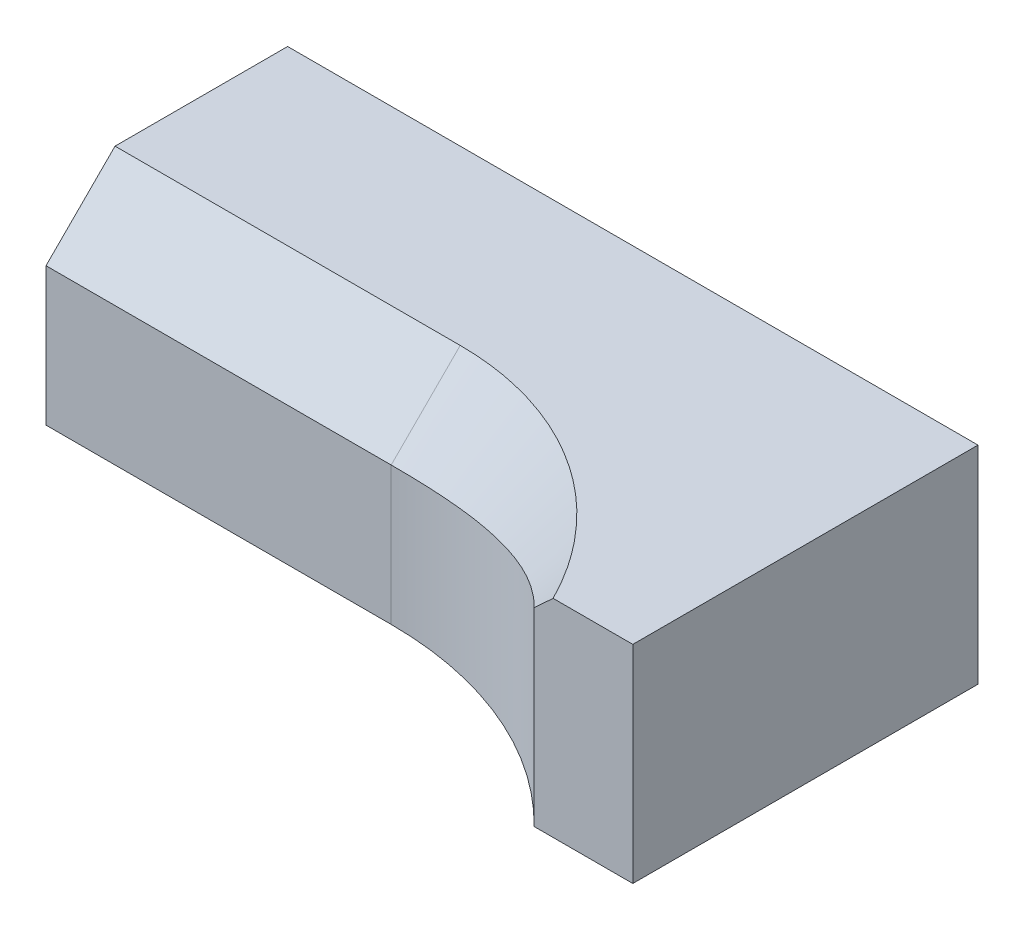
ISO-10303-21;
HEADER;
FILE_DESCRIPTION(('STEP AP214'),'2;1');
FILE_NAME('part.step','',(''),(''),'','','');
FILE_SCHEMA(('AUTOMOTIVE_DESIGN { 1 0 10303 214 1 1 1 1 }'));
ENDSEC;
DATA;
#1=APPLICATION_CONTEXT('core data for automotive mechanical design processes');
#2=APPLICATION_PROTOCOL_DEFINITION('international standard','automotive_design',2000,#1);
#3=PRODUCT_CONTEXT('',#1,'mechanical');
#4=PRODUCT('Part','Part','',(#3));
#5=PRODUCT_RELATED_PRODUCT_CATEGORY('part','',(#4));
#6=PRODUCT_DEFINITION_FORMATION('','',#4);
#7=PRODUCT_DEFINITION_CONTEXT('part definition',#1,'design');
#8=PRODUCT_DEFINITION('design','',#6,#7);
#9=PRODUCT_DEFINITION_SHAPE('','',#8);
#10=(LENGTH_UNIT() NAMED_UNIT(*) SI_UNIT(.MILLI.,.METRE.));
#11=(NAMED_UNIT(*) PLANE_ANGLE_UNIT() SI_UNIT($,.RADIAN.));
#12=(NAMED_UNIT(*) SI_UNIT($,.STERADIAN.) SOLID_ANGLE_UNIT());
#13=UNCERTAINTY_MEASURE_WITH_UNIT(LENGTH_MEASURE(1.E-05),#10,'distance_accuracy_value','');
#14=(GEOMETRIC_REPRESENTATION_CONTEXT(3) GLOBAL_UNCERTAINTY_ASSIGNED_CONTEXT((#13)) GLOBAL_UNIT_ASSIGNED_CONTEXT((#10,
#11,#12)) REPRESENTATION_CONTEXT('',''));
#15=CARTESIAN_POINT('',(0.,0.,0.));
#16=DIRECTION('',(0.,0.,1.));
#17=DIRECTION('',(1.,0.,0.));
#18=AXIS2_PLACEMENT_3D('',#15,#16,#17);
#19=CARTESIAN_POINT('',(-5.00000000000113,30.,-10.));
#20=CARTESIAN_POINT('',(13.3333333333364,30.,-10.));
#21=CARTESIAN_POINT('',(31.6666666666739,30.,-10.));
#22=CARTESIAN_POINT('',(50.0000000000114,30.,-10.));
#23=CARTESIAN_POINT('',(-5.00000000000113,20.,0.));
#24=CARTESIAN_POINT('',(13.3333333333364,20.,0.));
#25=CARTESIAN_POINT('',(31.6666666666739,20.,0.));
#26=CARTESIAN_POINT('',(50.0000000000114,20.,0.));
#27=B_SPLINE_SURFACE_WITH_KNOTS('',1,3,((#19,#20,#21,#22),(#23,#24,#25,#26)),.UNSPECIFIED.,.F.,
.F.,.F.,(2,2),(4,4),(0.,1.),(-0.00500000000000112,0.0500000000000114),.UNSPECIFIED.);
#28=CARTESIAN_POINT('',(50.0000000000114,30.,-10.));
#29=CARTESIAN_POINT('',(50.0000000000114,20.,0.));
#30=B_SPLINE_CURVE_WITH_KNOTS('',1,(#28,#29),.UNSPECIFIED.,.F.,.F.,(2,2),(0.,1.),.UNSPECIFIED.);
#31=CARTESIAN_POINT('',(50.0000000000114,30.,-10.));
#32=VERTEX_POINT('',#31);
#33=CARTESIAN_POINT('',(50.0000000000114,20.,0.));
#34=VERTEX_POINT('',#33);
#35=EDGE_CURVE('E11',#32,#34,#30,.T.);
#36=CARTESIAN_POINT('',(50.0000000000114,30.,-10.));
#37=CARTESIAN_POINT('',(31.6666666666739,30.,-10.));
#38=CARTESIAN_POINT('',(13.3333333333364,30.,-10.));
#39=CARTESIAN_POINT('',(-5.00000000000113,30.,-10.));
#40=B_SPLINE_CURVE_WITH_KNOTS('',3,(#36,#37,#38,#39),.UNSPECIFIED.,.F.,.F.,(4,4),
(-0.00500000000000112,0.0500000000000114),.UNSPECIFIED.);
#41=CARTESIAN_POINT('',(0.,30.,-10.));
#42=VERTEX_POINT('',#41);
#43=EDGE_CURVE('E131',#42,#32,#40,.F.);
#44=CARTESIAN_POINT('',(0.,30.,-10.));
#45=CARTESIAN_POINT('',(0.,20.,0.));
#46=B_SPLINE_CURVE_WITH_KNOTS('',1,(#44,#45),.UNSPECIFIED.,.F.,.F.,(2,2),(0.,1.),.UNSPECIFIED.);
#47=CARTESIAN_POINT('',(0.,20.,0.));
#48=VERTEX_POINT('',#47);
#49=EDGE_CURVE('E56',#48,#42,#46,.F.);
#50=CARTESIAN_POINT('',(-5.00000000000113,20.,0.));
#51=CARTESIAN_POINT('',(13.3333333333364,20.,0.));
#52=CARTESIAN_POINT('',(31.6666666666739,20.,0.));
#53=CARTESIAN_POINT('',(50.0000000000114,20.,0.));
#54=B_SPLINE_CURVE_WITH_KNOTS('',3,(#50,#51,#52,#53),.UNSPECIFIED.,.F.,.F.,(4,4),
(-0.00500000000000112,0.0500000000000114),.UNSPECIFIED.);
#55=EDGE_CURVE('E267',#34,#48,#54,.F.);
#56=ORIENTED_EDGE('',*,*,#35,.F.);
#57=ORIENTED_EDGE('',*,*,#43,.F.);
#58=ORIENTED_EDGE('',*,*,#49,.F.);
#59=ORIENTED_EDGE('',*,*,#55,.F.);
#60=EDGE_LOOP('',(#56,#57,#58,#59));
#61=FACE_BOUND('',#60,.T.);
#62=ADVANCED_FACE('F37',(#61),#27,.T.);
#63=CARTESIAN_POINT('',(50.0000000000114,30.,-10.));
#64=CARTESIAN_POINT('',(52.1054454325357,30.,-10.0000000000073));
#65=CARTESIAN_POINT('',(54.2211702506604,30.,-9.82468905903506));
#66=CARTESIAN_POINT('',(58.4581062829058,30.,-9.1248387362801));
#67=CARTESIAN_POINT('',(60.5477726799049,30.,-8.60537906626276));
#68=CARTESIAN_POINT('',(63.631619388189,30.,-7.57375582507435));
#69=CARTESIAN_POINT('',(64.6480874828233,30.,-7.18857099443179));
#70=CARTESIAN_POINT('',(66.6580620557991,30.,-6.33558049926557));
#71=CARTESIAN_POINT('',(67.6539001880962,30.,-5.86662090988998));
#72=CARTESIAN_POINT('',(69.6109290033174,30.,-4.85186416263024));
#73=CARTESIAN_POINT('',(70.5701237964009,30.,-4.30705476146158));
#74=CARTESIAN_POINT('',(72.4498741535874,30.,-3.14257390410074));
#75=CARTESIAN_POINT('',(73.3722547012452,30.,-2.52151304699523));
#76=CARTESIAN_POINT('',(76.0634093678156,30.,-0.559762614607957));
#77=CARTESIAN_POINT('',(77.7579710608643,30.,0.880845826832923));
#78=CARTESIAN_POINT('',(80.1505014734552,30.,3.24092071887319));
#79=CARTESIAN_POINT('',(80.9231262564942,30.,4.0608060544991));
#80=CARTESIAN_POINT('',(82.4186051135371,30.,5.76696413571837));
#81=CARTESIAN_POINT('',(83.139262843814,30.,6.65092846070325));
#82=CARTESIAN_POINT('',(85.2005879492319,30.,9.37508418649001));
#83=CARTESIAN_POINT('',(86.4481628663955,30.,11.295479520296));
#84=CARTESIAN_POINT('',(87.8493292381453,30.,13.8263380833428));
#85=CARTESIAN_POINT('',(88.1216473987594,30.,14.3390280157385));
#86=CARTESIAN_POINT('',(88.6504534925154,30.,15.3774443201008));
#87=CARTESIAN_POINT('',(88.912174558706,30.,15.8988611252728));
#88=CARTESIAN_POINT('',(89.7010663645784,30.,17.460040974439));
#89=CARTESIAN_POINT('',(90.2269942351436,30.,18.5008275405513));
#90=CARTESIAN_POINT('',(90.752922105737,30.,19.5416141066555));
#91=CARTESIAN_POINT('',(50.0000000000114,20.,0.));
#92=CARTESIAN_POINT('',(51.7544740831113,20.0000000000292,0.));
#93=CARTESIAN_POINT('',(53.5177817116621,20.0648969708573,0.0917201759601044));
#94=CARTESIAN_POINT('',(57.0815476281944,20.3117181240894,0.471595358266706));
#95=CARTESIAN_POINT('',(58.8554728759382,20.4920055011781,0.756872802646197));
#96=CARTESIAN_POINT('',(61.5200500924567,20.8442964012276,1.336721340673));
#97=CARTESIAN_POINT('',(62.4062550484878,20.9751920659311,1.55488303031477));
#98=CARTESIAN_POINT('',(64.178076566605,21.2631504589081,2.04349191813337));
#99=CARTESIAN_POINT('',(65.0657910969154,21.4205405253271,2.31466358609776));
#100=CARTESIAN_POINT('',(66.8331711344106,21.758012679072,2.90951561257188));
#101=CARTESIAN_POINT('',(67.7110418185186,21.9379610043211,3.23244510398838));
#102=CARTESIAN_POINT('',(69.4579258496428,22.3203311977452,3.93185140600266));
#103=CARTESIAN_POINT('',(70.328717701442,22.5231846439757,4.30920865964614));
#104=CARTESIAN_POINT('',(72.9139347305588,23.1595071526229,5.51885453438657));
#105=CARTESIAN_POINT('',(74.6031586316657,23.6224552747128,6.42818594066864));
#106=CARTESIAN_POINT('',(77.0972555888223,24.3738186138075,7.96794867813995));
#107=CARTESIAN_POINT('',(77.9219476855979,24.6336349246182,8.51066026756141));
#108=CARTESIAN_POINT('',(79.5589112974834,25.1701493426328,9.66054986866433));
#109=CARTESIAN_POINT('',(80.3688100847084,25.44603126314,10.2662797828309));
#110=CARTESIAN_POINT('',(82.7533882450935,26.2915628974574,12.1668379395328));
#111=CARTESIAN_POINT('',(84.2915231375691,26.8819463176469,13.5499212001902));
#112=CARTESIAN_POINT('',(86.1473891941793,27.6474046793407,15.4507806937591));
#113=CARTESIAN_POINT('',(86.5151777820275,27.8018233977288,15.8396017142634));
#114=CARTESIAN_POINT('',(87.2437214499585,28.1129723887259,16.6354045124004));
#115=CARTESIAN_POINT('',(87.6047405756152,28.2629303992049,17.0426857304355));
#116=CARTESIAN_POINT('',(88.676056609013,28.6800128445489,18.2924779324763));
#117=CARTESIAN_POINT('',(89.37434930724,28.9207431863644,19.1627708716983));
#118=CARTESIAN_POINT('',(90.0500908322028,29.1225597009517,20.0669041973067));
#119=B_SPLINE_SURFACE_WITH_KNOTS('',1,3,((#63,#64,#65,#66,#67,#68,#69,#70,#71,#72,#73,#74,#75,
#76,#77,#78,#79,#80,#81,#82,#83,#84,#85,#86,#87,#88,#89,#90),(#91,#92,#93,#94,#95,#96,#97,#98,
#99,#100,#101,#102,#103,#104,#105,#106,#107,#108,#109,#110,#111,#112,#113,#114,#115,#116,#117,
#118)),.UNSPECIFIED.,.F.,.F.,.F.,(2,2),(4,2,2,2,2,2,2,2,2,2,2,2,2,4),(0.,1.),(0.,0.1375,0.275,
0.34375,0.4125,0.48125,0.55,0.6875,0.75625,0.825,0.9625,0.996875,1.03125,1.1),.UNSPECIFIED.);
#120=CARTESIAN_POINT('',(90.752922105737,30.,19.5416141066555));
#121=CARTESIAN_POINT('',(90.2269942351436,30.,18.5008275405513));
#122=CARTESIAN_POINT('',(89.7010663645784,30.,17.460040974439));
#123=CARTESIAN_POINT('',(88.912174558706,30.,15.8988611252728));
#124=CARTESIAN_POINT('',(88.6504534925154,30.,15.3774443201008));
#125=CARTESIAN_POINT('',(88.1216473987594,30.,14.3390280157385));
#126=CARTESIAN_POINT('',(87.8493292381453,30.,13.8263380833428));
#127=CARTESIAN_POINT('',(86.4481628663955,30.,11.295479520296));
#128=CARTESIAN_POINT('',(85.2005879492319,30.,9.37508418649001));
#129=CARTESIAN_POINT('',(83.139262843814,30.,6.65092846070325));
#130=CARTESIAN_POINT('',(82.4186051135371,30.,5.76696413571837));
#131=CARTESIAN_POINT('',(80.9231262564942,30.,4.0608060544991));
#132=CARTESIAN_POINT('',(80.1505014734552,30.,3.24092071887319));
#133=CARTESIAN_POINT('',(77.7579710608643,30.,0.880845826832923));
#134=CARTESIAN_POINT('',(76.0634093678156,30.,-0.559762614607957));
#135=CARTESIAN_POINT('',(73.3722547012452,30.,-2.52151304699523));
#136=CARTESIAN_POINT('',(72.4498741535874,30.,-3.14257390410074));
#137=CARTESIAN_POINT('',(70.5701237964009,30.,-4.30705476146158));
#138=CARTESIAN_POINT('',(69.6109290033174,30.,-4.85186416263024));
#139=CARTESIAN_POINT('',(67.6539001880962,30.,-5.86662090988998));
#140=CARTESIAN_POINT('',(66.6580620557991,30.,-6.33558049926557));
#141=CARTESIAN_POINT('',(64.6480874828233,30.,-7.18857099443179));
#142=CARTESIAN_POINT('',(63.631619388189,30.,-7.57375582507435));
#143=CARTESIAN_POINT('',(60.5477726799049,30.,-8.60537906626276));
#144=CARTESIAN_POINT('',(58.4581062829058,30.,-9.1248387362801));
#145=CARTESIAN_POINT('',(54.2211702506604,30.,-9.82468905903506));
#146=CARTESIAN_POINT('',(52.1054454325357,30.,-10.0000000000073));
#147=CARTESIAN_POINT('',(50.0000000000114,30.,-10.));
#148=B_SPLINE_CURVE_WITH_KNOTS('',3,(#120,#121,#122,#123,#124,#125,#126,#127,#128,#129,#130,
#131,#132,#133,#134,#135,#136,#137,#138,#139,#140,#141,#142,#143,#144,#145,#146,#147),
.UNSPECIFIED.,.F.,.F.,(4,2,2,2,2,2,2,2,2,2,2,2,2,4),(0.,0.0687500000000001,0.103125,0.1375,
0.275,0.34375,0.4125,0.55,0.61875,0.6875,0.75625,0.825,0.9625,1.1),.UNSPECIFIED.);
#149=CARTESIAN_POINT('',(88.4579641250251,30.,15.));
#150=VERTEX_POINT('',#149);
#151=EDGE_CURVE('E134',#32,#150,#148,.F.);
#152=CARTESIAN_POINT('',(50.0000000000114,20.,0.));
#153=CARTESIAN_POINT('',(51.7544740831113,20.0000000000292,0.));
#154=CARTESIAN_POINT('',(53.5177817116621,20.0648969708573,0.0917201759601044));
#155=CARTESIAN_POINT('',(57.0815476281944,20.3117181240894,0.471595358266706));
#156=CARTESIAN_POINT('',(58.8554728759382,20.4920055011781,0.756872802646197));
#157=CARTESIAN_POINT('',(61.5200500924567,20.8442964012276,1.336721340673));
#158=CARTESIAN_POINT('',(62.4062550484878,20.9751920659311,1.55488303031477));
#159=CARTESIAN_POINT('',(64.178076566605,21.2631504589081,2.04349191813337));
#160=CARTESIAN_POINT('',(65.0657910969154,21.4205405253271,2.31466358609776));
#161=CARTESIAN_POINT('',(66.8331711344106,21.758012679072,2.90951561257188));
#162=CARTESIAN_POINT('',(67.7110418185186,21.9379610043211,3.23244510398838));
#163=CARTESIAN_POINT('',(69.4579258496428,22.3203311977452,3.93185140600266));
#164=CARTESIAN_POINT('',(70.328717701442,22.5231846439757,4.30920865964614));
#165=CARTESIAN_POINT('',(72.9139347305588,23.1595071526229,5.51885453438657));
#166=CARTESIAN_POINT('',(74.6031586316657,23.6224552747128,6.42818594066864));
#167=CARTESIAN_POINT('',(77.0972555888223,24.3738186138075,7.96794867813995));
#168=CARTESIAN_POINT('',(77.9219476855979,24.6336349246182,8.51066026756141));
#169=CARTESIAN_POINT('',(79.5589112974834,25.1701493426328,9.66054986866433));
#170=CARTESIAN_POINT('',(80.3688100847084,25.44603126314,10.2662797828309));
#171=CARTESIAN_POINT('',(82.7533882450935,26.2915628974574,12.1668379395328));
#172=CARTESIAN_POINT('',(84.2915231375691,26.8819463176469,13.5499212001902));
#173=CARTESIAN_POINT('',(86.1473891941793,27.6474046793407,15.4507806937591));
#174=CARTESIAN_POINT('',(86.5151777820275,27.8018233977288,15.8396017142634));
#175=CARTESIAN_POINT('',(87.2437214499585,28.1129723887259,16.6354045124004));
#176=CARTESIAN_POINT('',(87.6047405756152,28.2629303992049,17.0426857304355));
#177=CARTESIAN_POINT('',(88.676056609013,28.6800128445489,18.2924779324763));
#178=CARTESIAN_POINT('',(89.37434930724,28.9207431863644,19.1627708716983));
#179=CARTESIAN_POINT('',(90.0500908322028,29.1225597009517,20.0669041973067));
#180=B_SPLINE_CURVE_WITH_KNOTS('',3,(#152,#153,#154,#155,#156,#157,#158,#159,#160,#161,#162,
#163,#164,#165,#166,#167,#168,#169,#170,#171,#172,#173,#174,#175,#176,#177,#178,#179),
.UNSPECIFIED.,.F.,.F.,(4,2,2,2,2,2,2,2,2,2,2,2,2,4),(0.,0.1375,0.275,0.34375,0.4125,0.48125,
0.55,0.6875,0.75625,0.825,0.9625,0.996875,1.03125,1.1),.UNSPECIFIED.);
#181=CARTESIAN_POINT('',(85.7070471943579,27.4656458875371,15.0000930680158));
#182=VERTEX_POINT('',#181);
#183=EDGE_CURVE('E175',#182,#34,#180,.F.);
#184=CARTESIAN_POINT('',(85.707128750792,27.4658494954564,14.9999852040555));
#185=CARTESIAN_POINT('',(85.8251932731406,27.5739748387153,14.99998181484));
#186=CARTESIAN_POINT('',(85.9432121822952,27.6821499785142,14.9999751939056));
#187=CARTESIAN_POINT('',(86.177144244438,27.896741326948,14.9999645582343));
#188=CARTESIAN_POINT('',(86.2930588578456,28.0031559435147,14.9999605008206));
#189=CARTESIAN_POINT('',(86.5226815359921,28.2141149333432,14.9999633135064));
#190=CARTESIAN_POINT('',(86.6363910238837,28.3186577576363,14.9999699842633));
#191=CARTESIAN_POINT('',(86.8615182132862,28.5257817142158,14.9999911522664));
#192=CARTESIAN_POINT('',(86.9729373286707,28.6283613096469,15.0000054942166));
#193=CARTESIAN_POINT('',(87.2019752531721,28.8393931084867,14.9999941960182));
#194=CARTESIAN_POINT('',(87.3195894311525,28.9478503380365,14.9999662560807));
#195=CARTESIAN_POINT('',(87.5528084755893,29.163062300216,14.9998987783109));
#196=CARTESIAN_POINT('',(87.6684145751275,29.2698156967402,14.9998594387802));
#197=CARTESIAN_POINT('',(87.8974715592442,29.4814621934763,14.999836004759));
#198=CARTESIAN_POINT('',(88.0109236148108,29.5863540264405,14.9998509241585));
#199=CARTESIAN_POINT('',(88.2355994876673,29.7941339957676,14.9999098612796));
#200=CARTESIAN_POINT('',(88.3468238504195,29.8970215423955,14.9999533091035));
#201=CARTESIAN_POINT('',(88.4580508717711,29.9999061837882,15.));
#202=B_SPLINE_CURVE_WITH_KNOTS('',3,(#184,#185,#186,#187,#188,#189,#190,#191,#192,#193,#194,
#195,#196,#197,#198,#199,#200,#201),.UNSPECIFIED.,.F.,.F.,(4,2,2,2,2,2,2,2,4),(0.,
0.480284154781758,0.952345982622259,1.41573719413185,1.87008408289683,2.35004715182149,
2.82211653099187,3.28564967523273,3.74019378693061),.UNSPECIFIED.);
#203=EDGE_CURVE('E49',#150,#182,#202,.F.);
#204=ORIENTED_EDGE('',*,*,#151,.F.);
#205=ORIENTED_EDGE('',*,*,#35,.T.);
#206=ORIENTED_EDGE('',*,*,#183,.F.);
#207=ORIENTED_EDGE('',*,*,#203,.F.);
#208=EDGE_LOOP('',(#204,#205,#206,#207));
#209=FACE_BOUND('',#208,.T.);
#210=ADVANCED_FACE('F225',(#209),#119,.T.);
#211=CARTESIAN_POINT('',(100.,30.,-35.));
#212=DIRECTION('',(0.,0.,1.));
#213=DIRECTION('',(1.,0.,0.));
#214=AXIS2_PLACEMENT_3D('',#211,#212,#213);
#215=PLANE('',#214);
#216=DIRECTION('',(-1.,0.,0.));
#217=VECTOR('',#216,1.);
#218=CARTESIAN_POINT('',(100.,0.,-35.));
#219=LINE('',#218,#217);
#220=CARTESIAN_POINT('',(100.,0.,-35.));
#221=VERTEX_POINT('',#220);
#222=CARTESIAN_POINT('',(0.,0.,-35.));
#223=VERTEX_POINT('',#222);
#224=EDGE_CURVE('E130',#221,#223,#219,.T.);
#225=ORIENTED_EDGE('',*,*,#224,.T.);
#226=DIRECTION('',(0.,-1.,0.));
#227=VECTOR('',#226,1.);
#228=CARTESIAN_POINT('',(0.,30.,-35.));
#229=LINE('',#228,#227);
#230=CARTESIAN_POINT('',(0.,30.,-35.));
#231=VERTEX_POINT('',#230);
#232=EDGE_CURVE('E111',#231,#223,#229,.T.);
#233=ORIENTED_EDGE('',*,*,#232,.F.);
#234=DIRECTION('',(-1.,0.,0.));
#235=VECTOR('',#234,1.);
#236=CARTESIAN_POINT('',(100.,30.,-35.));
#237=LINE('',#236,#235);
#238=CARTESIAN_POINT('',(100.,30.,-35.));
#239=VERTEX_POINT('',#238);
#240=EDGE_CURVE('E117',#239,#231,#237,.T.);
#241=ORIENTED_EDGE('',*,*,#240,.F.);
#242=DIRECTION('',(0.,-1.,0.));
#243=VECTOR('',#242,1.);
#244=CARTESIAN_POINT('',(100.,30.,-35.));
#245=LINE('',#244,#243);
#246=EDGE_CURVE('E148',#239,#221,#245,.T.);
#247=ORIENTED_EDGE('',*,*,#246,.T.);
#248=EDGE_LOOP('',(#225,#233,#241,#247));
#249=FACE_BOUND('',#248,.T.);
#250=ADVANCED_FACE('F128',(#249),#215,.F.);
#251=CARTESIAN_POINT('',(0.,30.,-35.));
#252=DIRECTION('',(1.,0.,0.));
#253=DIRECTION('',(0.,0.,-1.));
#254=AXIS2_PLACEMENT_3D('',#251,#252,#253);
#255=PLANE('',#254);
#256=DIRECTION('',(0.,-1.,0.));
#257=VECTOR('',#256,1.);
#258=CARTESIAN_POINT('',(0.,30.,0.));
#259=LINE('',#258,#257);
#260=CARTESIAN_POINT('',(0.,0.,0.));
#261=VERTEX_POINT('',#260);
#262=EDGE_CURVE('E132',#48,#261,#259,.T.);
#263=ORIENTED_EDGE('',*,*,#262,.F.);
#264=ORIENTED_EDGE('',*,*,#49,.T.);
#265=DIRECTION('',(0.,0.,1.));
#266=VECTOR('',#265,1.);
#267=CARTESIAN_POINT('',(0.,30.,-35.));
#268=LINE('',#267,#266);
#269=EDGE_CURVE('E105',#231,#42,#268,.T.);
#270=ORIENTED_EDGE('',*,*,#269,.F.);
#271=ORIENTED_EDGE('',*,*,#232,.T.);
#272=DIRECTION('',(0.,0.,1.));
#273=VECTOR('',#272,1.);
#274=CARTESIAN_POINT('',(0.,0.,-35.));
#275=LINE('',#274,#273);
#276=EDGE_CURVE('E150',#223,#261,#275,.T.);
#277=ORIENTED_EDGE('',*,*,#276,.T.);
#278=EDGE_LOOP('',(#263,#264,#270,#271,#277));
#279=FACE_BOUND('',#278,.T.);
#280=ADVANCED_FACE('F108',(#279),#255,.F.);
#281=CARTESIAN_POINT('',(0.,30.,0.));
#282=DIRECTION('',(0.,0.,-1.));
#283=DIRECTION('',(-1.,0.,0.));
#284=AXIS2_PLACEMENT_3D('',#281,#282,#283);
#285=PLANE('',#284);
#286=DIRECTION('',(0.,-1.,0.));
#287=VECTOR('',#286,1.);
#288=CARTESIAN_POINT('',(50.0000000000114,30.,0.));
#289=LINE('',#288,#287);
#290=CARTESIAN_POINT('',(50.0000000000114,0.,0.));
#291=VERTEX_POINT('',#290);
#292=EDGE_CURVE('E135',#34,#291,#289,.T.);
#293=ORIENTED_EDGE('',*,*,#292,.F.);
#294=ORIENTED_EDGE('',*,*,#55,.T.);
#295=ORIENTED_EDGE('',*,*,#262,.T.);
#296=DIRECTION('',(1.,0.,0.));
#297=VECTOR('',#296,1.);
#298=CARTESIAN_POINT('',(0.,0.,0.));
#299=LINE('',#298,#297);
#300=EDGE_CURVE('E152',#261,#291,#299,.T.);
#301=ORIENTED_EDGE('',*,*,#300,.T.);
#302=EDGE_LOOP('',(#293,#294,#295,#301));
#303=FACE_BOUND('',#302,.T.);
#304=ADVANCED_FACE('F192',(#303),#285,.F.);
#305=CARTESIAN_POINT('',(50.0000000000114,30.,50.));
#306=DIRECTION('',(0.,-1.,0.));
#307=DIRECTION('',(0.,0.,-1.));
#308=AXIS2_PLACEMENT_3D('',#305,#306,#307);
#309=CYLINDRICAL_SURFACE('',#308,50.);
#310=DIRECTION('',(0.,-1.,0.));
#311=VECTOR('',#310,1.);
#312=CARTESIAN_POINT('',(85.7071421427256,30.,15.));
#313=LINE('',#312,#311);
#314=CARTESIAN_POINT('',(85.7071421427256,0.,15.));
#315=VERTEX_POINT('',#314);
#316=EDGE_CURVE('E164',#182,#315,#313,.T.);
#317=ORIENTED_EDGE('',*,*,#316,.F.);
#318=ORIENTED_EDGE('',*,*,#183,.T.);
#319=ORIENTED_EDGE('',*,*,#292,.T.);
#320=CARTESIAN_POINT('',(50.0000000000114,0.,50.));
#321=DIRECTION('',(0.,-1.,0.));
#322=DIRECTION('',(0.,0.,-1.));
#323=AXIS2_PLACEMENT_3D('',#320,#321,#322);
#324=CIRCLE('',#323,50.);
#325=EDGE_CURVE('E155',#291,#315,#324,.T.);
#326=ORIENTED_EDGE('',*,*,#325,.T.);
#327=EDGE_LOOP('',(#317,#318,#319,#326));
#328=FACE_BOUND('',#327,.T.);
#329=ADVANCED_FACE('F181',(#328),#309,.F.);
#330=CARTESIAN_POINT('',(85.7071421427256,30.,15.));
#331=DIRECTION('',(0.,0.,-1.));
#332=DIRECTION('',(-1.,0.,0.));
#333=AXIS2_PLACEMENT_3D('',#330,#331,#332);
#334=PLANE('',#333);
#335=DIRECTION('',(1.,0.,0.));
#336=VECTOR('',#335,1.);
#337=CARTESIAN_POINT('',(85.7071421427256,30.,15.));
#338=LINE('',#337,#336);
#339=CARTESIAN_POINT('',(100.,30.,15.));
#340=VERTEX_POINT('',#339);
#341=EDGE_CURVE('E116',#150,#340,#338,.T.);
#342=ORIENTED_EDGE('',*,*,#341,.F.);
#343=ORIENTED_EDGE('',*,*,#203,.T.);
#344=ORIENTED_EDGE('',*,*,#316,.T.);
#345=DIRECTION('',(1.,0.,0.));
#346=VECTOR('',#345,1.);
#347=CARTESIAN_POINT('',(85.7071421427256,0.,15.));
#348=LINE('',#347,#346);
#349=CARTESIAN_POINT('',(100.,0.,15.));
#350=VERTEX_POINT('',#349);
#351=EDGE_CURVE('E158',#315,#350,#348,.T.);
#352=ORIENTED_EDGE('',*,*,#351,.T.);
#353=DIRECTION('',(0.,-1.,0.));
#354=VECTOR('',#353,1.);
#355=CARTESIAN_POINT('',(100.,30.,15.));
#356=LINE('',#355,#354);
#357=EDGE_CURVE('E162',#340,#350,#356,.T.);
#358=ORIENTED_EDGE('',*,*,#357,.F.);
#359=EDGE_LOOP('',(#342,#343,#344,#352,#358));
#360=FACE_BOUND('',#359,.T.);
#361=ADVANCED_FACE('F191',(#360),#334,.F.);
#362=CARTESIAN_POINT('',(100.,30.,15.));
#363=DIRECTION('',(-1.,0.,0.));
#364=DIRECTION('',(0.,0.,1.));
#365=AXIS2_PLACEMENT_3D('',#362,#363,#364);
#366=PLANE('',#365);
#367=DIRECTION('',(0.,0.,-1.));
#368=VECTOR('',#367,1.);
#369=CARTESIAN_POINT('',(100.,0.,15.));
#370=LINE('',#369,#368);
#371=EDGE_CURVE('E126',#350,#221,#370,.T.);
#372=ORIENTED_EDGE('',*,*,#371,.T.);
#373=ORIENTED_EDGE('',*,*,#246,.F.);
#374=DIRECTION('',(0.,0.,-1.));
#375=VECTOR('',#374,1.);
#376=CARTESIAN_POINT('',(100.,30.,15.));
#377=LINE('',#376,#375);
#378=EDGE_CURVE('E122',#340,#239,#377,.T.);
#379=ORIENTED_EDGE('',*,*,#378,.F.);
#380=ORIENTED_EDGE('',*,*,#357,.T.);
#381=EDGE_LOOP('',(#372,#373,#379,#380));
#382=FACE_BOUND('',#381,.T.);
#383=ADVANCED_FACE('F262',(#382),#366,.F.);
#384=CARTESIAN_POINT('',(50.0000000000114,30.,50.));
#385=DIRECTION('',(0.,-1.,0.));
#386=DIRECTION('',(0.,0.,-1.));
#387=AXIS2_PLACEMENT_3D('',#384,#385,#386);
#388=PLANE('',#387);
#389=ORIENTED_EDGE('',*,*,#43,.T.);
#390=ORIENTED_EDGE('',*,*,#151,.T.);
#391=ORIENTED_EDGE('',*,*,#341,.T.);
#392=ORIENTED_EDGE('',*,*,#378,.T.);
#393=ORIENTED_EDGE('',*,*,#240,.T.);
#394=ORIENTED_EDGE('',*,*,#269,.T.);
#395=EDGE_LOOP('',(#389,#390,#391,#392,#393,#394));
#396=FACE_BOUND('',#395,.T.);
#397=ADVANCED_FACE('F120',(#396),#388,.F.);
#398=CARTESIAN_POINT('',(50.0000000000114,0.,50.));
#399=DIRECTION('',(0.,-1.,0.));
#400=DIRECTION('',(0.,0.,-1.));
#401=AXIS2_PLACEMENT_3D('',#398,#399,#400);
#402=PLANE('',#401);
#403=ORIENTED_EDGE('',*,*,#224,.F.);
#404=ORIENTED_EDGE('',*,*,#371,.F.);
#405=ORIENTED_EDGE('',*,*,#351,.F.);
#406=ORIENTED_EDGE('',*,*,#325,.F.);
#407=ORIENTED_EDGE('',*,*,#300,.F.);
#408=ORIENTED_EDGE('',*,*,#276,.F.);
#409=EDGE_LOOP('',(#403,#404,#405,#406,#407,#408));
#410=FACE_BOUND('',#409,.T.);
#411=ADVANCED_FACE('F264',(#410),#402,.T.);
#412=CLOSED_SHELL('',(#62,#210,#250,#280,#304,#329,#361,#383,#397,#411));
#413=MANIFOLD_SOLID_BREP('B2',#412);
#414=ADVANCED_BREP_SHAPE_REPRESENTATION('',(#18,#413),#14);
#415=SHAPE_DEFINITION_REPRESENTATION(#9,#414);
ENDSEC;
END-ISO-10303-21;
